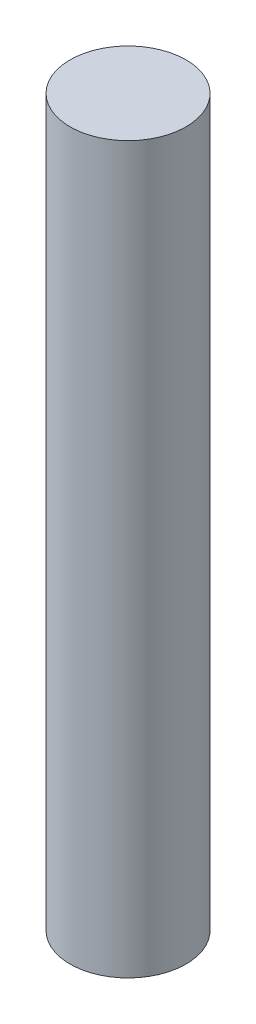
ISO-10303-21;
HEADER;
FILE_DESCRIPTION(('STEP AP214'),'2;1');
FILE_NAME('part.step','',(''),(''),'','','');
FILE_SCHEMA(('AUTOMOTIVE_DESIGN { 1 0 10303 214 1 1 1 1 }'));
ENDSEC;
DATA;
#1=APPLICATION_CONTEXT('core data for automotive mechanical design processes');
#2=APPLICATION_PROTOCOL_DEFINITION('international standard','automotive_design',2000,#1);
#3=PRODUCT_CONTEXT('',#1,'mechanical');
#4=PRODUCT('Part','Part','',(#3));
#5=PRODUCT_RELATED_PRODUCT_CATEGORY('part','',(#4));
#6=PRODUCT_DEFINITION_FORMATION('','',#4);
#7=PRODUCT_DEFINITION_CONTEXT('part definition',#1,'design');
#8=PRODUCT_DEFINITION('design','',#6,#7);
#9=PRODUCT_DEFINITION_SHAPE('','',#8);
#10=(LENGTH_UNIT() NAMED_UNIT(*) SI_UNIT(.MILLI.,.METRE.));
#11=(NAMED_UNIT(*) PLANE_ANGLE_UNIT() SI_UNIT($,.RADIAN.));
#12=(NAMED_UNIT(*) SI_UNIT($,.STERADIAN.) SOLID_ANGLE_UNIT());
#13=UNCERTAINTY_MEASURE_WITH_UNIT(LENGTH_MEASURE(1.E-05),#10,'distance_accuracy_value','');
#14=(GEOMETRIC_REPRESENTATION_CONTEXT(3) GLOBAL_UNCERTAINTY_ASSIGNED_CONTEXT((#13)) GLOBAL_UNIT_ASSIGNED_CONTEXT((#10,
#11,#12)) REPRESENTATION_CONTEXT('',''));
#15=CARTESIAN_POINT('',(0.,0.,0.));
#16=DIRECTION('',(0.,0.,1.));
#17=DIRECTION('',(1.,0.,0.));
#18=AXIS2_PLACEMENT_3D('',#15,#16,#17);
#19=CARTESIAN_POINT('',(0.,10.,0.));
#20=DIRECTION('',(0.,-1.,0.));
#21=DIRECTION('',(0.,0.,-1.));
#22=AXIS2_PLACEMENT_3D('',#19,#20,#21);
#23=CYLINDRICAL_SURFACE('',#22,4.);
#24=CARTESIAN_POINT('',(0.,50.,0.));
#25=DIRECTION('',(0.,-1.,0.));
#26=DIRECTION('',(0.,0.,-1.));
#27=AXIS2_PLACEMENT_3D('',#24,#25,#26);
#28=CIRCLE('',#27,4.);
#29=CARTESIAN_POINT('',(0.,50.,-4.));
#30=VERTEX_POINT('',#29);
#31=EDGE_CURVE('E10',#30,#30,#28,.T.);
#32=ORIENTED_EDGE('',*,*,#31,.T.);
#33=EDGE_LOOP('',(#32));
#34=FACE_BOUND('',#33,.T.);
#35=CARTESIAN_POINT('',(0.,0.,0.));
#36=DIRECTION('',(0.,-1.,0.));
#37=DIRECTION('',(0.,0.,-1.));
#38=AXIS2_PLACEMENT_3D('',#35,#36,#37);
#39=CIRCLE('',#38,4.);
#40=CARTESIAN_POINT('',(0.,0.,-4.));
#41=VERTEX_POINT('',#40);
#42=EDGE_CURVE('E43',#41,#41,#39,.T.);
#43=ORIENTED_EDGE('',*,*,#42,.F.);
#44=EDGE_LOOP('',(#43));
#45=FACE_BOUND('',#44,.T.);
#46=ADVANCED_FACE('F29',(#34,#45),#23,.T.);
#47=CARTESIAN_POINT('',(4.,50.,0.));
#48=DIRECTION('',(0.,1.,0.));
#49=DIRECTION('',(0.,0.,1.));
#50=AXIS2_PLACEMENT_3D('',#47,#48,#49);
#51=PLANE('',#50);
#52=ORIENTED_EDGE('',*,*,#31,.F.);
#53=EDGE_LOOP('',(#52));
#54=FACE_BOUND('',#53,.T.);
#55=ADVANCED_FACE('F53',(#54),#51,.T.);
#56=CARTESIAN_POINT('',(2.5,10.,0.));
#57=DIRECTION('',(0.,-1.,0.));
#58=DIRECTION('',(0.,0.,-1.));
#59=AXIS2_PLACEMENT_3D('',#56,#57,#58);
#60=PLANE('',#59);
#61=CARTESIAN_POINT('',(0.,10.,0.));
#62=DIRECTION('',(0.,-1.,0.));
#63=DIRECTION('',(0.,0.,-1.));
#64=AXIS2_PLACEMENT_3D('',#61,#62,#63);
#65=CIRCLE('',#64,2.5);
#66=CARTESIAN_POINT('',(0.,10.,-2.5));
#67=VERTEX_POINT('',#66);
#68=EDGE_CURVE('E35',#67,#67,#65,.T.);
#69=ORIENTED_EDGE('',*,*,#68,.T.);
#70=EDGE_LOOP('',(#69));
#71=FACE_BOUND('',#70,.T.);
#72=ADVANCED_FACE('F57',(#71),#60,.T.);
#73=CARTESIAN_POINT('',(0.,10.,0.));
#74=DIRECTION('',(0.,-1.,0.));
#75=DIRECTION('',(0.,0.,-1.));
#76=AXIS2_PLACEMENT_3D('',#73,#74,#75);
#77=CYLINDRICAL_SURFACE('',#76,2.5);
#78=CARTESIAN_POINT('',(0.,0.,0.));
#79=DIRECTION('',(0.,-1.,0.));
#80=DIRECTION('',(0.,0.,-1.));
#81=AXIS2_PLACEMENT_3D('',#78,#79,#80);
#82=CIRCLE('',#81,2.5);
#83=CARTESIAN_POINT('',(0.,0.,-2.5));
#84=VERTEX_POINT('',#83);
#85=EDGE_CURVE('E39',#84,#84,#82,.T.);
#86=ORIENTED_EDGE('',*,*,#85,.T.);
#87=EDGE_LOOP('',(#86));
#88=FACE_BOUND('',#87,.T.);
#89=ORIENTED_EDGE('',*,*,#68,.F.);
#90=EDGE_LOOP('',(#89));
#91=FACE_BOUND('',#90,.T.);
#92=ADVANCED_FACE('F62',(#88,#91),#77,.F.);
#93=CARTESIAN_POINT('',(2.5,0.,0.));
#94=DIRECTION('',(0.,-1.,0.));
#95=DIRECTION('',(0.,0.,-1.));
#96=AXIS2_PLACEMENT_3D('',#93,#94,#95);
#97=PLANE('',#96);
#98=ORIENTED_EDGE('',*,*,#42,.T.);
#99=EDGE_LOOP('',(#98));
#100=FACE_BOUND('',#99,.T.);
#101=ORIENTED_EDGE('',*,*,#85,.F.);
#102=EDGE_LOOP('',(#101));
#103=FACE_BOUND('',#102,.T.);
#104=ADVANCED_FACE('F49',(#100,#103),#97,.T.);
#105=CLOSED_SHELL('',(#46,#55,#72,#92,#104));
#106=MANIFOLD_SOLID_BREP('B2',#105);
#107=ADVANCED_BREP_SHAPE_REPRESENTATION('',(#18,#106),#14);
#108=SHAPE_DEFINITION_REPRESENTATION(#9,#107);
ENDSEC;
END-ISO-10303-21;
